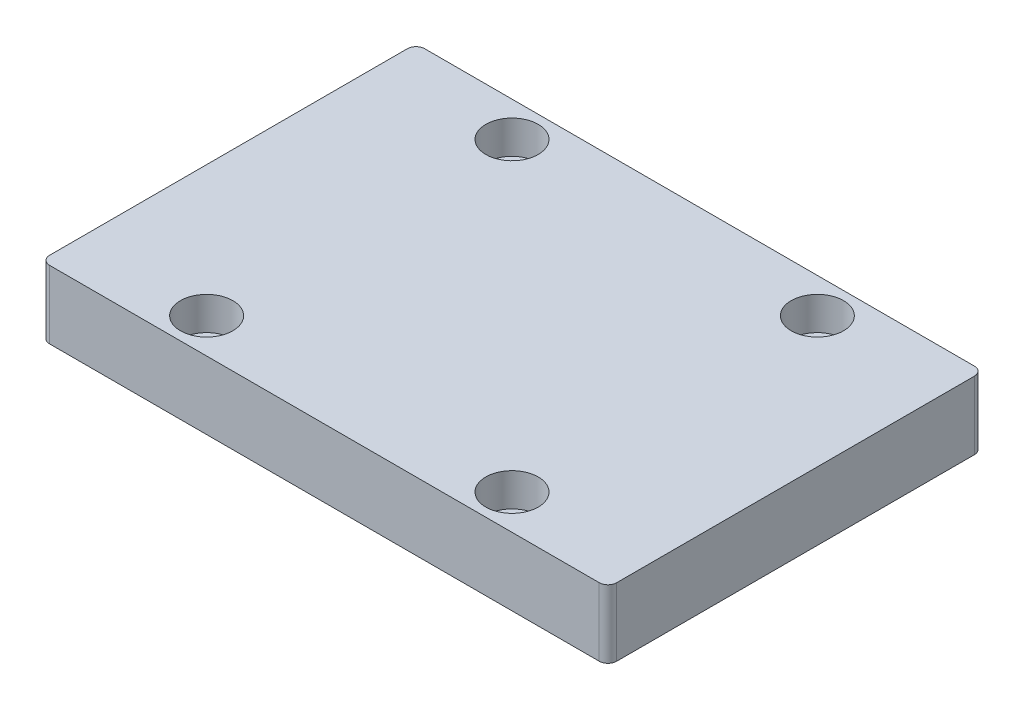
ISO-10303-21;
HEADER;
FILE_DESCRIPTION(('STEP AP214'),'2;1');
FILE_NAME('part.step','',(''),(''),'','','');
FILE_SCHEMA(('AUTOMOTIVE_DESIGN { 1 0 10303 214 1 1 1 1 }'));
ENDSEC;
DATA;
#1=APPLICATION_CONTEXT('core data for automotive mechanical design processes');
#2=APPLICATION_PROTOCOL_DEFINITION('international standard','automotive_design',2000,#1);
#3=PRODUCT_CONTEXT('',#1,'mechanical');
#4=PRODUCT('Part','Part','',(#3));
#5=PRODUCT_RELATED_PRODUCT_CATEGORY('part','',(#4));
#6=PRODUCT_DEFINITION_FORMATION('','',#4);
#7=PRODUCT_DEFINITION_CONTEXT('part definition',#1,'design');
#8=PRODUCT_DEFINITION('design','',#6,#7);
#9=PRODUCT_DEFINITION_SHAPE('','',#8);
#10=(LENGTH_UNIT() NAMED_UNIT(*) SI_UNIT(.MILLI.,.METRE.));
#11=(NAMED_UNIT(*) PLANE_ANGLE_UNIT() SI_UNIT($,.RADIAN.));
#12=(NAMED_UNIT(*) SI_UNIT($,.STERADIAN.) SOLID_ANGLE_UNIT());
#13=UNCERTAINTY_MEASURE_WITH_UNIT(LENGTH_MEASURE(1.E-05),#10,'distance_accuracy_value','');
#14=(GEOMETRIC_REPRESENTATION_CONTEXT(3) GLOBAL_UNCERTAINTY_ASSIGNED_CONTEXT((#13)) GLOBAL_UNIT_ASSIGNED_CONTEXT((#10,
#11,#12)) REPRESENTATION_CONTEXT('',''));
#15=CARTESIAN_POINT('',(0.,0.,0.));
#16=DIRECTION('',(0.,0.,1.));
#17=DIRECTION('',(1.,0.,0.));
#18=AXIS2_PLACEMENT_3D('',#15,#16,#17);
#19=CARTESIAN_POINT('',(-17.5,-0.00100000000000013,-17.5));
#20=DIRECTION('',(0.,1.,0.));
#21=DIRECTION('',(0.,0.,1.));
#22=AXIS2_PLACEMENT_3D('',#19,#20,#21);
#23=CYLINDRICAL_SURFACE('',#22,1.6);
#24=CARTESIAN_POINT('',(-17.5,0.,-17.5));
#25=DIRECTION('',(0.,1.,0.));
#26=DIRECTION('',(0.,0.,1.));
#27=AXIS2_PLACEMENT_3D('',#24,#25,#26);
#28=CIRCLE('',#27,1.6);
#29=CARTESIAN_POINT('',(-17.5,0.,-15.9));
#30=VERTEX_POINT('',#29);
#31=EDGE_CURVE('E186',#30,#30,#28,.F.);
#32=ORIENTED_EDGE('',*,*,#31,.T.);
#33=EDGE_LOOP('',(#32));
#34=FACE_BOUND('',#33,.T.);
#35=CARTESIAN_POINT('',(-17.5,4.,-17.5));
#36=DIRECTION('',(0.,1.,0.));
#37=DIRECTION('',(0.,0.,1.));
#38=AXIS2_PLACEMENT_3D('',#35,#36,#37);
#39=CIRCLE('',#38,1.6);
#40=CARTESIAN_POINT('',(-17.5,4.,-15.9));
#41=VERTEX_POINT('',#40);
#42=EDGE_CURVE('E42',#41,#41,#39,.F.);
#43=ORIENTED_EDGE('',*,*,#42,.F.);
#44=EDGE_LOOP('',(#43));
#45=FACE_BOUND('',#44,.T.);
#46=ADVANCED_FACE('F38',(#34,#45),#23,.F.);
#47=CARTESIAN_POINT('',(17.5,-0.00100000000000013,-17.5));
#48=DIRECTION('',(0.,1.,0.));
#49=DIRECTION('',(0.,0.,1.));
#50=AXIS2_PLACEMENT_3D('',#47,#48,#49);
#51=CYLINDRICAL_SURFACE('',#50,1.6);
#52=CARTESIAN_POINT('',(17.5,0.,-17.5));
#53=DIRECTION('',(0.,1.,0.));
#54=DIRECTION('',(0.,0.,1.));
#55=AXIS2_PLACEMENT_3D('',#52,#53,#54);
#56=CIRCLE('',#55,1.6);
#57=CARTESIAN_POINT('',(17.5,0.,-15.9));
#58=VERTEX_POINT('',#57);
#59=EDGE_CURVE('E182',#58,#58,#56,.F.);
#60=ORIENTED_EDGE('',*,*,#59,.T.);
#61=EDGE_LOOP('',(#60));
#62=FACE_BOUND('',#61,.T.);
#63=CARTESIAN_POINT('',(17.5,4.,-17.5));
#64=DIRECTION('',(0.,1.,0.));
#65=DIRECTION('',(0.,0.,1.));
#66=AXIS2_PLACEMENT_3D('',#63,#64,#65);
#67=CIRCLE('',#66,1.6);
#68=CARTESIAN_POINT('',(17.5,4.,-15.9));
#69=VERTEX_POINT('',#68);
#70=EDGE_CURVE('E168',#69,#69,#67,.F.);
#71=ORIENTED_EDGE('',*,*,#70,.F.);
#72=EDGE_LOOP('',(#71));
#73=FACE_BOUND('',#72,.T.);
#74=ADVANCED_FACE('F216',(#62,#73),#51,.F.);
#75=CARTESIAN_POINT('',(17.5000000000004,-0.00100000000000013,17.5));
#76=DIRECTION('',(0.,1.,0.));
#77=DIRECTION('',(0.,0.,1.));
#78=AXIS2_PLACEMENT_3D('',#75,#76,#77);
#79=CYLINDRICAL_SURFACE('',#78,1.6);
#80=CARTESIAN_POINT('',(17.5000000000004,0.,17.5));
#81=DIRECTION('',(0.,1.,0.));
#82=DIRECTION('',(0.,0.,1.));
#83=AXIS2_PLACEMENT_3D('',#80,#81,#82);
#84=CIRCLE('',#83,1.6);
#85=CARTESIAN_POINT('',(17.5000000000004,0.,19.1));
#86=VERTEX_POINT('',#85);
#87=EDGE_CURVE('E177',#86,#86,#84,.F.);
#88=ORIENTED_EDGE('',*,*,#87,.T.);
#89=EDGE_LOOP('',(#88));
#90=FACE_BOUND('',#89,.T.);
#91=CARTESIAN_POINT('',(17.5000000000004,4.,17.5));
#92=DIRECTION('',(0.,1.,0.));
#93=DIRECTION('',(0.,0.,1.));
#94=AXIS2_PLACEMENT_3D('',#91,#92,#93);
#95=CIRCLE('',#94,1.6);
#96=CARTESIAN_POINT('',(17.5000000000004,4.,19.1));
#97=VERTEX_POINT('',#96);
#98=EDGE_CURVE('E165',#97,#97,#95,.F.);
#99=ORIENTED_EDGE('',*,*,#98,.F.);
#100=EDGE_LOOP('',(#99));
#101=FACE_BOUND('',#100,.T.);
#102=ADVANCED_FACE('F222',(#90,#101),#79,.F.);
#103=CARTESIAN_POINT('',(-17.4999999999996,-0.00100000000000013,17.5));
#104=DIRECTION('',(0.,1.,0.));
#105=DIRECTION('',(0.,0.,1.));
#106=AXIS2_PLACEMENT_3D('',#103,#104,#105);
#107=CYLINDRICAL_SURFACE('',#106,1.6);
#108=CARTESIAN_POINT('',(-17.4999999999996,0.,17.5));
#109=DIRECTION('',(0.,1.,0.));
#110=DIRECTION('',(0.,0.,1.));
#111=AXIS2_PLACEMENT_3D('',#108,#109,#110);
#112=CIRCLE('',#111,1.6);
#113=CARTESIAN_POINT('',(-17.4999999999996,0.,19.1));
#114=VERTEX_POINT('',#113);
#115=EDGE_CURVE('E173',#114,#114,#112,.F.);
#116=ORIENTED_EDGE('',*,*,#115,.T.);
#117=EDGE_LOOP('',(#116));
#118=FACE_BOUND('',#117,.T.);
#119=CARTESIAN_POINT('',(-17.4999999999996,4.,17.5));
#120=DIRECTION('',(0.,1.,0.));
#121=DIRECTION('',(0.,0.,1.));
#122=AXIS2_PLACEMENT_3D('',#119,#120,#121);
#123=CIRCLE('',#122,1.6);
#124=CARTESIAN_POINT('',(-17.4999999999996,4.,19.1));
#125=VERTEX_POINT('',#124);
#126=EDGE_CURVE('E162',#125,#125,#123,.F.);
#127=ORIENTED_EDGE('',*,*,#126,.F.);
#128=EDGE_LOOP('',(#127));
#129=FACE_BOUND('',#128,.T.);
#130=ADVANCED_FACE('F228',(#118,#129),#107,.F.);
#131=CARTESIAN_POINT('',(-32.5,7.8,21.5));
#132=DIRECTION('',(1.,0.,0.));
#133=DIRECTION('',(0.,0.,-1.));
#134=AXIS2_PLACEMENT_3D('',#131,#132,#133);
#135=PLANE('',#134);
#136=DIRECTION('',(0.,0.,1.));
#137=VECTOR('',#136,1.);
#138=CARTESIAN_POINT('',(-32.5,7.8,21.5));
#139=LINE('',#138,#137);
#140=CARTESIAN_POINT('',(-32.5,7.8,-20.5));
#141=VERTEX_POINT('',#140);
#142=CARTESIAN_POINT('',(-32.5,7.8,20.5));
#143=VERTEX_POINT('',#142);
#144=EDGE_CURVE('E132',#141,#143,#139,.T.);
#145=ORIENTED_EDGE('',*,*,#144,.F.);
#146=DIRECTION('',(0.,-1.,0.));
#147=VECTOR('',#146,1.);
#148=CARTESIAN_POINT('',(-32.5,7.8,-20.5));
#149=LINE('',#148,#147);
#150=CARTESIAN_POINT('',(-32.5,0.,-20.5));
#151=VERTEX_POINT('',#150);
#152=EDGE_CURVE('E158',#141,#151,#149,.T.);
#153=ORIENTED_EDGE('',*,*,#152,.T.);
#154=DIRECTION('',(0.,0.,1.));
#155=VECTOR('',#154,1.);
#156=CARTESIAN_POINT('',(-32.5,0.,21.5));
#157=LINE('',#156,#155);
#158=CARTESIAN_POINT('',(-32.5,0.,20.5));
#159=VERTEX_POINT('',#158);
#160=EDGE_CURVE('E188',#151,#159,#157,.T.);
#161=ORIENTED_EDGE('',*,*,#160,.T.);
#162=DIRECTION('',(0.,-1.,0.));
#163=VECTOR('',#162,1.);
#164=CARTESIAN_POINT('',(-32.5,7.8,20.5));
#165=LINE('',#164,#163);
#166=EDGE_CURVE('E156',#159,#143,#165,.F.);
#167=ORIENTED_EDGE('',*,*,#166,.T.);
#168=EDGE_LOOP('',(#145,#153,#161,#167));
#169=FACE_BOUND('',#168,.T.);
#170=ADVANCED_FACE('F213',(#169),#135,.F.);
#171=CARTESIAN_POINT('',(32.5,7.8,21.5));
#172=DIRECTION('',(0.,0.,-1.));
#173=DIRECTION('',(-1.,0.,0.));
#174=AXIS2_PLACEMENT_3D('',#171,#172,#173);
#175=PLANE('',#174);
#176=DIRECTION('',(1.,0.,0.));
#177=VECTOR('',#176,1.);
#178=CARTESIAN_POINT('',(32.5,7.8,21.5));
#179=LINE('',#178,#177);
#180=CARTESIAN_POINT('',(-31.5,7.8,21.5));
#181=VERTEX_POINT('',#180);
#182=CARTESIAN_POINT('',(31.5,7.8,21.5));
#183=VERTEX_POINT('',#182);
#184=EDGE_CURVE('E135',#181,#183,#179,.T.);
#185=ORIENTED_EDGE('',*,*,#184,.F.);
#186=DIRECTION('',(0.,-1.,0.));
#187=VECTOR('',#186,1.);
#188=CARTESIAN_POINT('',(-31.5,7.8,21.5));
#189=LINE('',#188,#187);
#190=CARTESIAN_POINT('',(-31.5,0.,21.5));
#191=VERTEX_POINT('',#190);
#192=EDGE_CURVE('E11',#181,#191,#189,.T.);
#193=ORIENTED_EDGE('',*,*,#192,.T.);
#194=DIRECTION('',(1.,0.,0.));
#195=VECTOR('',#194,1.);
#196=CARTESIAN_POINT('',(32.5,0.,21.5));
#197=LINE('',#196,#195);
#198=CARTESIAN_POINT('',(31.5,0.,21.5));
#199=VERTEX_POINT('',#198);
#200=EDGE_CURVE('E137',#191,#199,#197,.T.);
#201=ORIENTED_EDGE('',*,*,#200,.T.);
#202=DIRECTION('',(0.,-1.,0.));
#203=VECTOR('',#202,1.);
#204=CARTESIAN_POINT('',(31.5,7.8,21.5));
#205=LINE('',#204,#203);
#206=EDGE_CURVE('E47',#199,#183,#205,.F.);
#207=ORIENTED_EDGE('',*,*,#206,.T.);
#208=EDGE_LOOP('',(#185,#193,#201,#207));
#209=FACE_BOUND('',#208,.T.);
#210=ADVANCED_FACE('F197',(#209),#175,.F.);
#211=CARTESIAN_POINT('',(32.5,7.8,21.5));
#212=DIRECTION('',(-1.,0.,0.));
#213=DIRECTION('',(0.,0.,1.));
#214=AXIS2_PLACEMENT_3D('',#211,#212,#213);
#215=PLANE('',#214);
#216=DIRECTION('',(0.,0.,-1.));
#217=VECTOR('',#216,1.);
#218=CARTESIAN_POINT('',(32.5,0.,21.5));
#219=LINE('',#218,#217);
#220=CARTESIAN_POINT('',(32.5,0.,20.5));
#221=VERTEX_POINT('',#220);
#222=CARTESIAN_POINT('',(32.5,0.,-20.5));
#223=VERTEX_POINT('',#222);
#224=EDGE_CURVE('E133',#221,#223,#219,.T.);
#225=ORIENTED_EDGE('',*,*,#224,.T.);
#226=DIRECTION('',(0.,-1.,0.));
#227=VECTOR('',#226,1.);
#228=CARTESIAN_POINT('',(32.5,7.8,-20.5));
#229=LINE('',#228,#227);
#230=CARTESIAN_POINT('',(32.5,7.8,-20.5));
#231=VERTEX_POINT('',#230);
#232=EDGE_CURVE('E111',#223,#231,#229,.F.);
#233=ORIENTED_EDGE('',*,*,#232,.T.);
#234=DIRECTION('',(0.,0.,-1.));
#235=VECTOR('',#234,1.);
#236=CARTESIAN_POINT('',(32.5,7.8,21.5));
#237=LINE('',#236,#235);
#238=CARTESIAN_POINT('',(32.5,7.8,20.5));
#239=VERTEX_POINT('',#238);
#240=EDGE_CURVE('E191',#239,#231,#237,.T.);
#241=ORIENTED_EDGE('',*,*,#240,.F.);
#242=DIRECTION('',(0.,-1.,0.));
#243=VECTOR('',#242,1.);
#244=CARTESIAN_POINT('',(32.5,7.8,20.5));
#245=LINE('',#244,#243);
#246=EDGE_CURVE('E116',#239,#221,#245,.T.);
#247=ORIENTED_EDGE('',*,*,#246,.T.);
#248=EDGE_LOOP('',(#225,#233,#241,#247));
#249=FACE_BOUND('',#248,.T.);
#250=ADVANCED_FACE('F205',(#249),#215,.F.);
#251=CARTESIAN_POINT('',(32.5,7.8,-21.5));
#252=DIRECTION('',(0.,0.,1.));
#253=DIRECTION('',(1.,0.,0.));
#254=AXIS2_PLACEMENT_3D('',#251,#252,#253);
#255=PLANE('',#254);
#256=DIRECTION('',(-1.,0.,0.));
#257=VECTOR('',#256,1.);
#258=CARTESIAN_POINT('',(32.5,7.8,-21.5));
#259=LINE('',#258,#257);
#260=CARTESIAN_POINT('',(31.5,7.8,-21.5));
#261=VERTEX_POINT('',#260);
#262=CARTESIAN_POINT('',(-31.5,7.8,-21.5));
#263=VERTEX_POINT('',#262);
#264=EDGE_CURVE('E126',#261,#263,#259,.T.);
#265=ORIENTED_EDGE('',*,*,#264,.F.);
#266=DIRECTION('',(0.,-1.,0.));
#267=VECTOR('',#266,1.);
#268=CARTESIAN_POINT('',(31.5,7.8,-21.5));
#269=LINE('',#268,#267);
#270=CARTESIAN_POINT('',(31.5,0.,-21.5));
#271=VERTEX_POINT('',#270);
#272=EDGE_CURVE('E110',#261,#271,#269,.T.);
#273=ORIENTED_EDGE('',*,*,#272,.T.);
#274=DIRECTION('',(-1.,0.,0.));
#275=VECTOR('',#274,1.);
#276=CARTESIAN_POINT('',(32.5,0.,-21.5));
#277=LINE('',#276,#275);
#278=CARTESIAN_POINT('',(-31.5,0.,-21.5));
#279=VERTEX_POINT('',#278);
#280=EDGE_CURVE('E123',#271,#279,#277,.T.);
#281=ORIENTED_EDGE('',*,*,#280,.T.);
#282=DIRECTION('',(0.,-1.,0.));
#283=VECTOR('',#282,1.);
#284=CARTESIAN_POINT('',(-31.5,7.8,-21.5));
#285=LINE('',#284,#283);
#286=EDGE_CURVE('E128',#279,#263,#285,.F.);
#287=ORIENTED_EDGE('',*,*,#286,.T.);
#288=EDGE_LOOP('',(#265,#273,#281,#287));
#289=FACE_BOUND('',#288,.T.);
#290=ADVANCED_FACE('F122',(#289),#255,.F.);
#291=CARTESIAN_POINT('',(0.,7.8,0.));
#292=DIRECTION('',(0.,1.,0.));
#293=DIRECTION('',(0.,0.,1.));
#294=AXIS2_PLACEMENT_3D('',#291,#292,#293);
#295=PLANE('',#294);
#296=CARTESIAN_POINT('',(-17.5,7.8,17.5));
#297=DIRECTION('',(0.,1.,0.));
#298=DIRECTION('',(0.,0.,1.));
#299=AXIS2_PLACEMENT_3D('',#296,#297,#298);
#300=CIRCLE('',#299,3.);
#301=CARTESIAN_POINT('',(-17.5,7.8,20.5));
#302=VERTEX_POINT('',#301);
#303=EDGE_CURVE('E257',#302,#302,#300,.T.);
#304=ORIENTED_EDGE('',*,*,#303,.F.);
#305=EDGE_LOOP('',(#304));
#306=FACE_BOUND('',#305,.T.);
#307=CARTESIAN_POINT('',(17.5,7.8,17.5));
#308=DIRECTION('',(0.,1.,0.));
#309=DIRECTION('',(0.,0.,1.));
#310=AXIS2_PLACEMENT_3D('',#307,#308,#309);
#311=CIRCLE('',#310,3.);
#312=CARTESIAN_POINT('',(17.5,7.8,20.5));
#313=VERTEX_POINT('',#312);
#314=EDGE_CURVE('E263',#313,#313,#311,.T.);
#315=ORIENTED_EDGE('',*,*,#314,.F.);
#316=EDGE_LOOP('',(#315));
#317=FACE_BOUND('',#316,.T.);
#318=CARTESIAN_POINT('',(17.5,7.8,-17.5));
#319=DIRECTION('',(0.,1.,0.));
#320=DIRECTION('',(0.,0.,1.));
#321=AXIS2_PLACEMENT_3D('',#318,#319,#320);
#322=CIRCLE('',#321,3.);
#323=CARTESIAN_POINT('',(17.5,7.8,-14.5));
#324=VERTEX_POINT('',#323);
#325=EDGE_CURVE('E251',#324,#324,#322,.T.);
#326=ORIENTED_EDGE('',*,*,#325,.F.);
#327=EDGE_LOOP('',(#326));
#328=FACE_BOUND('',#327,.T.);
#329=CARTESIAN_POINT('',(-17.5,7.8,-17.5));
#330=DIRECTION('',(0.,1.,0.));
#331=DIRECTION('',(0.,0.,1.));
#332=AXIS2_PLACEMENT_3D('',#329,#330,#331);
#333=CIRCLE('',#332,3.);
#334=CARTESIAN_POINT('',(-17.5,7.8,-14.5));
#335=VERTEX_POINT('',#334);
#336=EDGE_CURVE('E248',#335,#335,#333,.T.);
#337=ORIENTED_EDGE('',*,*,#336,.F.);
#338=EDGE_LOOP('',(#337));
#339=FACE_BOUND('',#338,.T.);
#340=ORIENTED_EDGE('',*,*,#240,.T.);
#341=CARTESIAN_POINT('',(31.5,7.8,-20.5));
#342=DIRECTION('',(0.,1.,0.));
#343=DIRECTION('',(0.,0.,1.));
#344=AXIS2_PLACEMENT_3D('',#341,#342,#343);
#345=CIRCLE('',#344,1.);
#346=EDGE_CURVE('E154',#231,#261,#345,.T.);
#347=ORIENTED_EDGE('',*,*,#346,.T.);
#348=ORIENTED_EDGE('',*,*,#264,.T.);
#349=CARTESIAN_POINT('',(-31.5,7.8,-20.5));
#350=DIRECTION('',(0.,1.,0.));
#351=DIRECTION('',(0.,0.,1.));
#352=AXIS2_PLACEMENT_3D('',#349,#350,#351);
#353=CIRCLE('',#352,1.);
#354=EDGE_CURVE('E152',#263,#141,#353,.T.);
#355=ORIENTED_EDGE('',*,*,#354,.T.);
#356=ORIENTED_EDGE('',*,*,#144,.T.);
#357=CARTESIAN_POINT('',(-31.5,7.8,20.5));
#358=DIRECTION('',(0.,1.,0.));
#359=DIRECTION('',(0.,0.,1.));
#360=AXIS2_PLACEMENT_3D('',#357,#358,#359);
#361=CIRCLE('',#360,1.);
#362=EDGE_CURVE('E61',#143,#181,#361,.T.);
#363=ORIENTED_EDGE('',*,*,#362,.T.);
#364=ORIENTED_EDGE('',*,*,#184,.T.);
#365=CARTESIAN_POINT('',(31.5,7.8,20.5));
#366=DIRECTION('',(0.,1.,0.));
#367=DIRECTION('',(0.,0.,1.));
#368=AXIS2_PLACEMENT_3D('',#365,#366,#367);
#369=CIRCLE('',#368,1.);
#370=EDGE_CURVE('E149',#183,#239,#369,.T.);
#371=ORIENTED_EDGE('',*,*,#370,.T.);
#372=EDGE_LOOP('',(#340,#347,#348,#355,#356,#363,#364,#371));
#373=FACE_BOUND('',#372,.T.);
#374=ADVANCED_FACE('F203',(#306,#317,#328,#339,#373),#295,.T.);
#375=CARTESIAN_POINT('',(0.,0.,0.));
#376=DIRECTION('',(0.,1.,0.));
#377=DIRECTION('',(0.,0.,1.));
#378=AXIS2_PLACEMENT_3D('',#375,#376,#377);
#379=PLANE('',#378);
#380=ORIENTED_EDGE('',*,*,#115,.F.);
#381=EDGE_LOOP('',(#380));
#382=FACE_BOUND('',#381,.T.);
#383=ORIENTED_EDGE('',*,*,#87,.F.);
#384=EDGE_LOOP('',(#383));
#385=FACE_BOUND('',#384,.T.);
#386=ORIENTED_EDGE('',*,*,#59,.F.);
#387=EDGE_LOOP('',(#386));
#388=FACE_BOUND('',#387,.T.);
#389=ORIENTED_EDGE('',*,*,#31,.F.);
#390=EDGE_LOOP('',(#389));
#391=FACE_BOUND('',#390,.T.);
#392=ORIENTED_EDGE('',*,*,#280,.F.);
#393=CARTESIAN_POINT('',(31.5,0.,-20.5));
#394=DIRECTION('',(0.,1.,0.));
#395=DIRECTION('',(0.,0.,1.));
#396=AXIS2_PLACEMENT_3D('',#393,#394,#395);
#397=CIRCLE('',#396,1.);
#398=EDGE_CURVE('E106',#271,#223,#397,.F.);
#399=ORIENTED_EDGE('',*,*,#398,.T.);
#400=ORIENTED_EDGE('',*,*,#224,.F.);
#401=CARTESIAN_POINT('',(31.5,0.,20.5));
#402=DIRECTION('',(0.,1.,0.));
#403=DIRECTION('',(0.,0.,1.));
#404=AXIS2_PLACEMENT_3D('',#401,#402,#403);
#405=CIRCLE('',#404,1.);
#406=EDGE_CURVE('E127',#221,#199,#405,.F.);
#407=ORIENTED_EDGE('',*,*,#406,.T.);
#408=ORIENTED_EDGE('',*,*,#200,.F.);
#409=CARTESIAN_POINT('',(-31.5,0.,20.5));
#410=DIRECTION('',(0.,1.,0.));
#411=DIRECTION('',(0.,0.,1.));
#412=AXIS2_PLACEMENT_3D('',#409,#410,#411);
#413=CIRCLE('',#412,1.);
#414=EDGE_CURVE('E143',#191,#159,#413,.F.);
#415=ORIENTED_EDGE('',*,*,#414,.T.);
#416=ORIENTED_EDGE('',*,*,#160,.F.);
#417=CARTESIAN_POINT('',(-31.5,0.,-20.5));
#418=DIRECTION('',(0.,1.,0.));
#419=DIRECTION('',(0.,0.,1.));
#420=AXIS2_PLACEMENT_3D('',#417,#418,#419);
#421=CIRCLE('',#420,1.);
#422=EDGE_CURVE('E117',#151,#279,#421,.F.);
#423=ORIENTED_EDGE('',*,*,#422,.T.);
#424=EDGE_LOOP('',(#392,#399,#400,#407,#408,#415,#416,#423));
#425=FACE_BOUND('',#424,.T.);
#426=ADVANCED_FACE('F130',(#382,#385,#388,#391,#425),#379,.F.);
#427=CARTESIAN_POINT('',(31.5,7.8,-20.5));
#428=DIRECTION('',(0.,-1.,0.));
#429=DIRECTION('',(0.,0.,-1.));
#430=AXIS2_PLACEMENT_3D('',#427,#428,#429);
#431=CYLINDRICAL_SURFACE('',#430,1.);
#432=ORIENTED_EDGE('',*,*,#346,.F.);
#433=ORIENTED_EDGE('',*,*,#232,.F.);
#434=ORIENTED_EDGE('',*,*,#398,.F.);
#435=ORIENTED_EDGE('',*,*,#272,.F.);
#436=EDGE_LOOP('',(#432,#433,#434,#435));
#437=FACE_BOUND('',#436,.T.);
#438=ADVANCED_FACE('F109',(#437),#431,.T.);
#439=CARTESIAN_POINT('',(-31.5,7.8,-20.5));
#440=DIRECTION('',(0.,-1.,0.));
#441=DIRECTION('',(0.,0.,-1.));
#442=AXIS2_PLACEMENT_3D('',#439,#440,#441);
#443=CYLINDRICAL_SURFACE('',#442,1.);
#444=ORIENTED_EDGE('',*,*,#354,.F.);
#445=ORIENTED_EDGE('',*,*,#286,.F.);
#446=ORIENTED_EDGE('',*,*,#422,.F.);
#447=ORIENTED_EDGE('',*,*,#152,.F.);
#448=EDGE_LOOP('',(#444,#445,#446,#447));
#449=FACE_BOUND('',#448,.T.);
#450=ADVANCED_FACE('F238',(#449),#443,.T.);
#451=CARTESIAN_POINT('',(-31.5,7.8,20.5));
#452=DIRECTION('',(0.,-1.,0.));
#453=DIRECTION('',(0.,0.,-1.));
#454=AXIS2_PLACEMENT_3D('',#451,#452,#453);
#455=CYLINDRICAL_SURFACE('',#454,1.);
#456=ORIENTED_EDGE('',*,*,#362,.F.);
#457=ORIENTED_EDGE('',*,*,#166,.F.);
#458=ORIENTED_EDGE('',*,*,#414,.F.);
#459=ORIENTED_EDGE('',*,*,#192,.F.);
#460=EDGE_LOOP('',(#456,#457,#458,#459));
#461=FACE_BOUND('',#460,.T.);
#462=ADVANCED_FACE('F319',(#461),#455,.T.);
#463=CARTESIAN_POINT('',(31.5,7.8,20.5));
#464=DIRECTION('',(0.,-1.,0.));
#465=DIRECTION('',(0.,0.,-1.));
#466=AXIS2_PLACEMENT_3D('',#463,#464,#465);
#467=CYLINDRICAL_SURFACE('',#466,1.);
#468=ORIENTED_EDGE('',*,*,#370,.F.);
#469=ORIENTED_EDGE('',*,*,#206,.F.);
#470=ORIENTED_EDGE('',*,*,#406,.F.);
#471=ORIENTED_EDGE('',*,*,#246,.F.);
#472=EDGE_LOOP('',(#468,#469,#470,#471));
#473=FACE_BOUND('',#472,.T.);
#474=ADVANCED_FACE('F40',(#473),#467,.T.);
#475=CARTESIAN_POINT('',(-17.5,4.,17.5));
#476=DIRECTION('',(0.,1.,0.));
#477=DIRECTION('',(0.,0.,1.));
#478=AXIS2_PLACEMENT_3D('',#475,#476,#477);
#479=PLANE('',#478);
#480=CARTESIAN_POINT('',(-17.5,4.,17.5));
#481=DIRECTION('',(0.,1.,0.));
#482=DIRECTION('',(0.,0.,1.));
#483=AXIS2_PLACEMENT_3D('',#480,#481,#482);
#484=CIRCLE('',#483,3.);
#485=CARTESIAN_POINT('',(-17.5,4.,20.5));
#486=VERTEX_POINT('',#485);
#487=EDGE_CURVE('E254',#486,#486,#484,.T.);
#488=ORIENTED_EDGE('',*,*,#487,.T.);
#489=EDGE_LOOP('',(#488));
#490=FACE_BOUND('',#489,.T.);
#491=ORIENTED_EDGE('',*,*,#126,.T.);
#492=EDGE_LOOP('',(#491));
#493=FACE_BOUND('',#492,.T.);
#494=ADVANCED_FACE('F310',(#490,#493),#479,.T.);
#495=CARTESIAN_POINT('',(-17.5,4.,17.5));
#496=DIRECTION('',(0.,1.,0.));
#497=DIRECTION('',(0.,0.,1.));
#498=AXIS2_PLACEMENT_3D('',#495,#496,#497);
#499=CYLINDRICAL_SURFACE('',#498,3.);
#500=ORIENTED_EDGE('',*,*,#487,.F.);
#501=EDGE_LOOP('',(#500));
#502=FACE_BOUND('',#501,.T.);
#503=ORIENTED_EDGE('',*,*,#303,.T.);
#504=EDGE_LOOP('',(#503));
#505=FACE_BOUND('',#504,.T.);
#506=ADVANCED_FACE('F300',(#502,#505),#499,.F.);
#507=CARTESIAN_POINT('',(17.5,4.,17.5));
#508=DIRECTION('',(0.,1.,0.));
#509=DIRECTION('',(0.,0.,1.));
#510=AXIS2_PLACEMENT_3D('',#507,#508,#509);
#511=PLANE('',#510);
#512=CARTESIAN_POINT('',(17.5,4.,17.5));
#513=DIRECTION('',(0.,1.,0.));
#514=DIRECTION('',(0.,0.,1.));
#515=AXIS2_PLACEMENT_3D('',#512,#513,#514);
#516=CIRCLE('',#515,3.);
#517=CARTESIAN_POINT('',(17.5,4.,20.5));
#518=VERTEX_POINT('',#517);
#519=EDGE_CURVE('E260',#518,#518,#516,.T.);
#520=ORIENTED_EDGE('',*,*,#519,.T.);
#521=EDGE_LOOP('',(#520));
#522=FACE_BOUND('',#521,.T.);
#523=ORIENTED_EDGE('',*,*,#98,.T.);
#524=EDGE_LOOP('',(#523));
#525=FACE_BOUND('',#524,.T.);
#526=ADVANCED_FACE('F297',(#522,#525),#511,.T.);
#527=CARTESIAN_POINT('',(17.5,4.,17.5));
#528=DIRECTION('',(0.,1.,0.));
#529=DIRECTION('',(0.,0.,1.));
#530=AXIS2_PLACEMENT_3D('',#527,#528,#529);
#531=CYLINDRICAL_SURFACE('',#530,3.);
#532=ORIENTED_EDGE('',*,*,#519,.F.);
#533=EDGE_LOOP('',(#532));
#534=FACE_BOUND('',#533,.T.);
#535=ORIENTED_EDGE('',*,*,#314,.T.);
#536=EDGE_LOOP('',(#535));
#537=FACE_BOUND('',#536,.T.);
#538=ADVANCED_FACE('F299',(#534,#537),#531,.F.);
#539=CARTESIAN_POINT('',(17.5,4.,-17.5));
#540=DIRECTION('',(0.,1.,0.));
#541=DIRECTION('',(0.,0.,1.));
#542=AXIS2_PLACEMENT_3D('',#539,#540,#541);
#543=PLANE('',#542);
#544=CARTESIAN_POINT('',(17.5,4.,-17.5));
#545=DIRECTION('',(0.,1.,0.));
#546=DIRECTION('',(0.,0.,1.));
#547=AXIS2_PLACEMENT_3D('',#544,#545,#546);
#548=CIRCLE('',#547,3.);
#549=CARTESIAN_POINT('',(17.5,4.,-14.5));
#550=VERTEX_POINT('',#549);
#551=EDGE_CURVE('E266',#550,#550,#548,.T.);
#552=ORIENTED_EDGE('',*,*,#551,.T.);
#553=EDGE_LOOP('',(#552));
#554=FACE_BOUND('',#553,.T.);
#555=ORIENTED_EDGE('',*,*,#70,.T.);
#556=EDGE_LOOP('',(#555));
#557=FACE_BOUND('',#556,.T.);
#558=ADVANCED_FACE('F307',(#554,#557),#543,.T.);
#559=CARTESIAN_POINT('',(17.5,4.,-17.5));
#560=DIRECTION('',(0.,1.,0.));
#561=DIRECTION('',(0.,0.,1.));
#562=AXIS2_PLACEMENT_3D('',#559,#560,#561);
#563=CYLINDRICAL_SURFACE('',#562,3.);
#564=ORIENTED_EDGE('',*,*,#551,.F.);
#565=EDGE_LOOP('',(#564));
#566=FACE_BOUND('',#565,.T.);
#567=ORIENTED_EDGE('',*,*,#325,.T.);
#568=EDGE_LOOP('',(#567));
#569=FACE_BOUND('',#568,.T.);
#570=ADVANCED_FACE('F272',(#566,#569),#563,.F.);
#571=CARTESIAN_POINT('',(-17.5,4.,-17.5));
#572=DIRECTION('',(0.,1.,0.));
#573=DIRECTION('',(0.,0.,1.));
#574=AXIS2_PLACEMENT_3D('',#571,#572,#573);
#575=PLANE('',#574);
#576=CARTESIAN_POINT('',(-17.5,4.,-17.5));
#577=DIRECTION('',(0.,1.,0.));
#578=DIRECTION('',(0.,0.,1.));
#579=AXIS2_PLACEMENT_3D('',#576,#577,#578);
#580=CIRCLE('',#579,3.);
#581=CARTESIAN_POINT('',(-17.5,4.,-14.5));
#582=VERTEX_POINT('',#581);
#583=EDGE_CURVE('E166',#582,#582,#580,.T.);
#584=ORIENTED_EDGE('',*,*,#583,.T.);
#585=EDGE_LOOP('',(#584));
#586=FACE_BOUND('',#585,.T.);
#587=ORIENTED_EDGE('',*,*,#42,.T.);
#588=EDGE_LOOP('',(#587));
#589=FACE_BOUND('',#588,.T.);
#590=ADVANCED_FACE('F279',(#586,#589),#575,.T.);
#591=CARTESIAN_POINT('',(-17.5,4.,-17.5));
#592=DIRECTION('',(0.,1.,0.));
#593=DIRECTION('',(0.,0.,1.));
#594=AXIS2_PLACEMENT_3D('',#591,#592,#593);
#595=CYLINDRICAL_SURFACE('',#594,3.);
#596=ORIENTED_EDGE('',*,*,#583,.F.);
#597=EDGE_LOOP('',(#596));
#598=FACE_BOUND('',#597,.T.);
#599=ORIENTED_EDGE('',*,*,#336,.T.);
#600=EDGE_LOOP('',(#599));
#601=FACE_BOUND('',#600,.T.);
#602=ADVANCED_FACE('F277',(#598,#601),#595,.F.);
#603=CLOSED_SHELL('',(#46,#74,#102,#130,#170,#210,#250,#290,#374,#426,#438,#450,#462,#474,#494,
#506,#526,#538,#558,#570,#590,#602));
#604=MANIFOLD_SOLID_BREP('B2',#603);
#605=ADVANCED_BREP_SHAPE_REPRESENTATION('',(#18,#604),#14);
#606=SHAPE_DEFINITION_REPRESENTATION(#9,#605);
ENDSEC;
END-ISO-10303-21;
